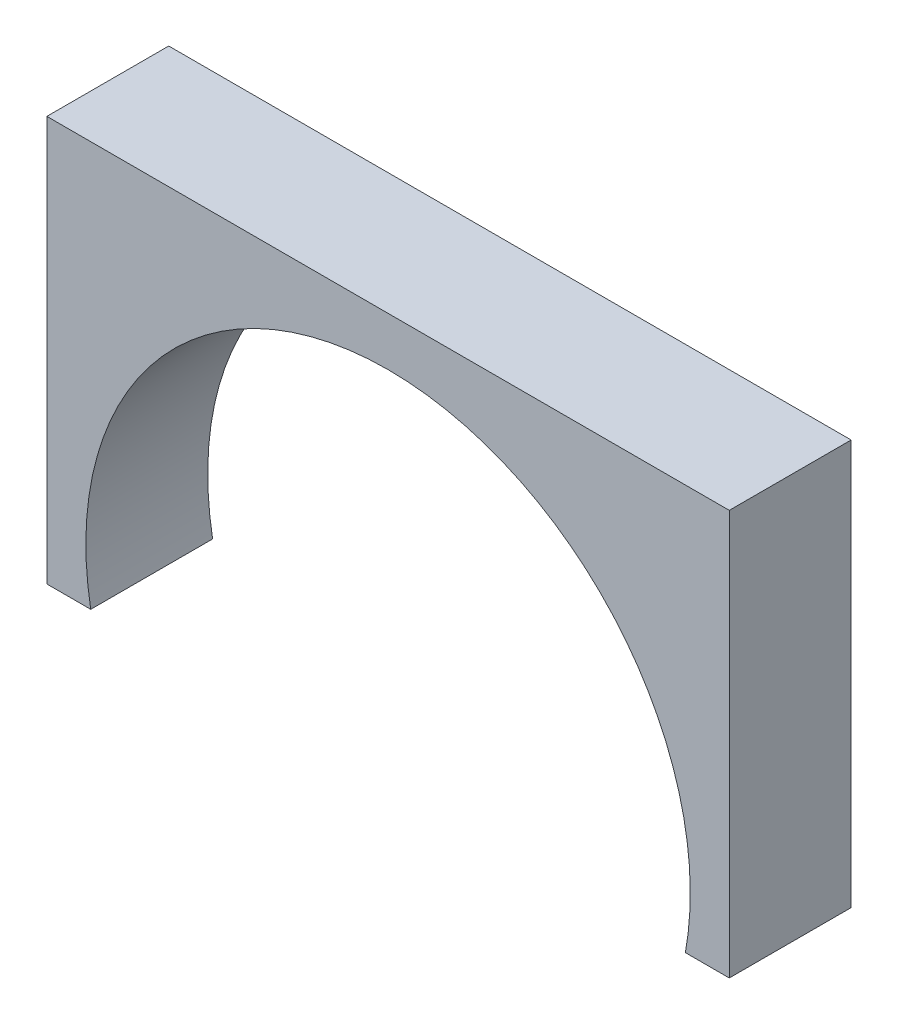
ISO-10303-21;
HEADER;
FILE_DESCRIPTION(('STEP AP214'),'2;1');
FILE_NAME('part.step','',(''),(''),'','','');
FILE_SCHEMA(('AUTOMOTIVE_DESIGN { 1 0 10303 214 1 1 1 1 }'));
ENDSEC;
DATA;
#1=APPLICATION_CONTEXT('core data for automotive mechanical design processes');
#2=APPLICATION_PROTOCOL_DEFINITION('international standard','automotive_design',2000,#1);
#3=PRODUCT_CONTEXT('',#1,'mechanical');
#4=PRODUCT('Part','Part','',(#3));
#5=PRODUCT_RELATED_PRODUCT_CATEGORY('part','',(#4));
#6=PRODUCT_DEFINITION_FORMATION('','',#4);
#7=PRODUCT_DEFINITION_CONTEXT('part definition',#1,'design');
#8=PRODUCT_DEFINITION('design','',#6,#7);
#9=PRODUCT_DEFINITION_SHAPE('','',#8);
#10=(LENGTH_UNIT() NAMED_UNIT(*) SI_UNIT(.MILLI.,.METRE.));
#11=(NAMED_UNIT(*) PLANE_ANGLE_UNIT() SI_UNIT($,.RADIAN.));
#12=(NAMED_UNIT(*) SI_UNIT($,.STERADIAN.) SOLID_ANGLE_UNIT());
#13=UNCERTAINTY_MEASURE_WITH_UNIT(LENGTH_MEASURE(1.E-05),#10,'distance_accuracy_value','');
#14=(GEOMETRIC_REPRESENTATION_CONTEXT(3) GLOBAL_UNCERTAINTY_ASSIGNED_CONTEXT((#13)) GLOBAL_UNIT_ASSIGNED_CONTEXT((#10,
#11,#12)) REPRESENTATION_CONTEXT('',''));
#15=CARTESIAN_POINT('',(0.,0.,0.));
#16=DIRECTION('',(0.,0.,1.));
#17=DIRECTION('',(1.,0.,0.));
#18=AXIS2_PLACEMENT_3D('',#15,#16,#17);
#19=CARTESIAN_POINT('',(-70.,72.,25.));
#20=DIRECTION('',(0.,-1.,0.));
#21=DIRECTION('',(0.,0.,-1.));
#22=AXIS2_PLACEMENT_3D('',#19,#20,#21);
#23=PLANE('',#22);
#24=DIRECTION('',(-1.,0.,0.));
#25=VECTOR('',#24,1.);
#26=CARTESIAN_POINT('',(-70.,72.,0.));
#27=LINE('',#26,#25);
#28=CARTESIAN_POINT('',(70.,72.,0.));
#29=VERTEX_POINT('',#28);
#30=CARTESIAN_POINT('',(-70.,72.,0.));
#31=VERTEX_POINT('',#30);
#32=EDGE_CURVE('E117',#29,#31,#27,.T.);
#33=ORIENTED_EDGE('',*,*,#32,.T.);
#34=DIRECTION('',(0.,0.,-1.));
#35=VECTOR('',#34,1.);
#36=CARTESIAN_POINT('',(-70.,72.,25.));
#37=LINE('',#36,#35);
#38=CARTESIAN_POINT('',(-70.,72.,25.));
#39=VERTEX_POINT('',#38);
#40=EDGE_CURVE('E11',#39,#31,#37,.T.);
#41=ORIENTED_EDGE('',*,*,#40,.F.);
#42=DIRECTION('',(-1.,0.,0.));
#43=VECTOR('',#42,1.);
#44=CARTESIAN_POINT('',(-70.,72.,25.));
#45=LINE('',#44,#43);
#46=CARTESIAN_POINT('',(70.,72.,25.));
#47=VERTEX_POINT('',#46);
#48=EDGE_CURVE('E127',#47,#39,#45,.T.);
#49=ORIENTED_EDGE('',*,*,#48,.F.);
#50=DIRECTION('',(0.,0.,-1.));
#51=VECTOR('',#50,1.);
#52=CARTESIAN_POINT('',(70.,72.,25.));
#53=LINE('',#52,#51);
#54=EDGE_CURVE('E113',#47,#29,#53,.T.);
#55=ORIENTED_EDGE('',*,*,#54,.T.);
#56=EDGE_LOOP('',(#33,#41,#49,#55));
#57=FACE_BOUND('',#56,.T.);
#58=ADVANCED_FACE('F33',(#57),#23,.F.);
#59=CARTESIAN_POINT('',(-70.,72.,25.));
#60=DIRECTION('',(1.,0.,0.));
#61=DIRECTION('',(0.,1.,0.));
#62=AXIS2_PLACEMENT_3D('',#59,#60,#61);
#63=PLANE('',#62);
#64=DIRECTION('',(0.,-1.,0.));
#65=VECTOR('',#64,1.);
#66=CARTESIAN_POINT('',(-70.,72.,0.));
#67=LINE('',#66,#65);
#68=CARTESIAN_POINT('',(-70.,-11.0905365064094,0.));
#69=VERTEX_POINT('',#68);
#70=EDGE_CURVE('E120',#31,#69,#67,.T.);
#71=ORIENTED_EDGE('',*,*,#70,.T.);
#72=DIRECTION('',(0.,0.,-1.));
#73=VECTOR('',#72,1.);
#74=CARTESIAN_POINT('',(-70.,-11.0905365064094,25.));
#75=LINE('',#74,#73);
#76=CARTESIAN_POINT('',(-70.,-11.0905365064094,25.));
#77=VERTEX_POINT('',#76);
#78=EDGE_CURVE('E41',#77,#69,#75,.T.);
#79=ORIENTED_EDGE('',*,*,#78,.F.);
#80=DIRECTION('',(0.,-1.,0.));
#81=VECTOR('',#80,1.);
#82=CARTESIAN_POINT('',(-70.,72.,25.));
#83=LINE('',#82,#81);
#84=EDGE_CURVE('E86',#39,#77,#83,.T.);
#85=ORIENTED_EDGE('',*,*,#84,.F.);
#86=ORIENTED_EDGE('',*,*,#40,.T.);
#87=EDGE_LOOP('',(#71,#79,#85,#86));
#88=FACE_BOUND('',#87,.T.);
#89=ADVANCED_FACE('F151',(#88),#63,.F.);
#90=CARTESIAN_POINT('',(-61.,-11.0905365064094,25.));
#91=DIRECTION('',(0.,1.,0.));
#92=DIRECTION('',(-1.,0.,0.));
#93=AXIS2_PLACEMENT_3D('',#90,#91,#92);
#94=PLANE('',#93);
#95=DIRECTION('',(1.,0.,0.));
#96=VECTOR('',#95,1.);
#97=CARTESIAN_POINT('',(-61.,-11.0905365064094,0.));
#98=LINE('',#97,#96);
#99=CARTESIAN_POINT('',(-61.,-11.0905365064094,0.));
#100=VERTEX_POINT('',#99);
#101=EDGE_CURVE('E122',#69,#100,#98,.T.);
#102=ORIENTED_EDGE('',*,*,#101,.T.);
#103=DIRECTION('',(0.,0.,-1.));
#104=VECTOR('',#103,1.);
#105=CARTESIAN_POINT('',(-61.,-11.0905365064094,25.));
#106=LINE('',#105,#104);
#107=CARTESIAN_POINT('',(-61.,-11.0905365064094,25.));
#108=VERTEX_POINT('',#107);
#109=EDGE_CURVE('E108',#108,#100,#106,.T.);
#110=ORIENTED_EDGE('',*,*,#109,.F.);
#111=DIRECTION('',(1.,0.,0.));
#112=VECTOR('',#111,1.);
#113=CARTESIAN_POINT('',(-61.,-11.0905365064094,25.));
#114=LINE('',#113,#112);
#115=EDGE_CURVE('E99',#77,#108,#114,.T.);
#116=ORIENTED_EDGE('',*,*,#115,.F.);
#117=ORIENTED_EDGE('',*,*,#78,.T.);
#118=EDGE_LOOP('',(#102,#110,#116,#117));
#119=FACE_BOUND('',#118,.T.);
#120=ADVANCED_FACE('F133',(#119),#94,.F.);
#121=CARTESIAN_POINT('',(0.,0.,25.));
#122=DIRECTION('',(0.,0.,-1.));
#123=DIRECTION('',(-1.,0.,0.));
#124=AXIS2_PLACEMENT_3D('',#121,#122,#123);
#125=CYLINDRICAL_SURFACE('',#124,62.);
#126=CARTESIAN_POINT('',(0.,0.,0.));
#127=DIRECTION('',(0.,0.,-1.));
#128=DIRECTION('',(1.,0.,0.));
#129=AXIS2_PLACEMENT_3D('',#126,#127,#128);
#130=CIRCLE('',#129,62.);
#131=CARTESIAN_POINT('',(61.,-11.0905365064094,0.));
#132=VERTEX_POINT('',#131);
#133=EDGE_CURVE('E107',#100,#132,#130,.T.);
#134=ORIENTED_EDGE('',*,*,#133,.T.);
#135=DIRECTION('',(0.,0.,-1.));
#136=VECTOR('',#135,1.);
#137=CARTESIAN_POINT('',(61.,-11.0905365064094,25.));
#138=LINE('',#137,#136);
#139=CARTESIAN_POINT('',(61.,-11.0905365064094,25.));
#140=VERTEX_POINT('',#139);
#141=EDGE_CURVE('E104',#140,#132,#138,.T.);
#142=ORIENTED_EDGE('',*,*,#141,.F.);
#143=CARTESIAN_POINT('',(0.,0.,25.));
#144=DIRECTION('',(0.,0.,-1.));
#145=DIRECTION('',(1.,0.,0.));
#146=AXIS2_PLACEMENT_3D('',#143,#144,#145);
#147=CIRCLE('',#146,62.);
#148=EDGE_CURVE('E93',#108,#140,#147,.T.);
#149=ORIENTED_EDGE('',*,*,#148,.F.);
#150=ORIENTED_EDGE('',*,*,#109,.T.);
#151=EDGE_LOOP('',(#134,#142,#149,#150));
#152=FACE_BOUND('',#151,.T.);
#153=ADVANCED_FACE('F105',(#152),#125,.F.);
#154=CARTESIAN_POINT('',(61.,-11.0905365064094,25.));
#155=DIRECTION('',(0.,1.,0.));
#156=DIRECTION('',(0.,0.,1.));
#157=AXIS2_PLACEMENT_3D('',#154,#155,#156);
#158=PLANE('',#157);
#159=DIRECTION('',(1.,0.,0.));
#160=VECTOR('',#159,1.);
#161=CARTESIAN_POINT('',(61.,-11.0905365064094,0.));
#162=LINE('',#161,#160);
#163=CARTESIAN_POINT('',(70.,-11.0905365064094,0.));
#164=VERTEX_POINT('',#163);
#165=EDGE_CURVE('E72',#132,#164,#162,.T.);
#166=ORIENTED_EDGE('',*,*,#165,.T.);
#167=DIRECTION('',(0.,0.,-1.));
#168=VECTOR('',#167,1.);
#169=CARTESIAN_POINT('',(70.,-11.0905365064094,25.));
#170=LINE('',#169,#168);
#171=CARTESIAN_POINT('',(70.,-11.0905365064094,25.));
#172=VERTEX_POINT('',#171);
#173=EDGE_CURVE('E109',#172,#164,#170,.T.);
#174=ORIENTED_EDGE('',*,*,#173,.F.);
#175=DIRECTION('',(1.,0.,0.));
#176=VECTOR('',#175,1.);
#177=CARTESIAN_POINT('',(61.,-11.0905365064094,25.));
#178=LINE('',#177,#176);
#179=EDGE_CURVE('E97',#140,#172,#178,.T.);
#180=ORIENTED_EDGE('',*,*,#179,.F.);
#181=ORIENTED_EDGE('',*,*,#141,.T.);
#182=EDGE_LOOP('',(#166,#174,#180,#181));
#183=FACE_BOUND('',#182,.T.);
#184=ADVANCED_FACE('F111',(#183),#158,.F.);
#185=CARTESIAN_POINT('',(70.,72.,25.));
#186=DIRECTION('',(-1.,0.,0.));
#187=DIRECTION('',(0.,-1.,0.));
#188=AXIS2_PLACEMENT_3D('',#185,#186,#187);
#189=PLANE('',#188);
#190=DIRECTION('',(0.,1.,0.));
#191=VECTOR('',#190,1.);
#192=CARTESIAN_POINT('',(70.,72.,0.));
#193=LINE('',#192,#191);
#194=EDGE_CURVE('E78',#164,#29,#193,.T.);
#195=ORIENTED_EDGE('',*,*,#194,.T.);
#196=ORIENTED_EDGE('',*,*,#54,.F.);
#197=DIRECTION('',(0.,1.,0.));
#198=VECTOR('',#197,1.);
#199=CARTESIAN_POINT('',(70.,72.,25.));
#200=LINE('',#199,#198);
#201=EDGE_CURVE('E49',#172,#47,#200,.T.);
#202=ORIENTED_EDGE('',*,*,#201,.F.);
#203=ORIENTED_EDGE('',*,*,#173,.T.);
#204=EDGE_LOOP('',(#195,#196,#202,#203));
#205=FACE_BOUND('',#204,.T.);
#206=ADVANCED_FACE('F140',(#205),#189,.F.);
#207=CARTESIAN_POINT('',(0.,0.,25.));
#208=DIRECTION('',(0.,0.,1.));
#209=DIRECTION('',(1.,0.,0.));
#210=AXIS2_PLACEMENT_3D('',#207,#208,#209);
#211=PLANE('',#210);
#212=ORIENTED_EDGE('',*,*,#48,.T.);
#213=ORIENTED_EDGE('',*,*,#84,.T.);
#214=ORIENTED_EDGE('',*,*,#115,.T.);
#215=ORIENTED_EDGE('',*,*,#148,.T.);
#216=ORIENTED_EDGE('',*,*,#179,.T.);
#217=ORIENTED_EDGE('',*,*,#201,.T.);
#218=EDGE_LOOP('',(#212,#213,#214,#215,#216,#217));
#219=FACE_BOUND('',#218,.T.);
#220=ADVANCED_FACE('F95',(#219),#211,.T.);
#221=CARTESIAN_POINT('',(0.,0.,0.));
#222=DIRECTION('',(0.,0.,1.));
#223=DIRECTION('',(1.,0.,0.));
#224=AXIS2_PLACEMENT_3D('',#221,#222,#223);
#225=PLANE('',#224);
#226=ORIENTED_EDGE('',*,*,#32,.F.);
#227=ORIENTED_EDGE('',*,*,#194,.F.);
#228=ORIENTED_EDGE('',*,*,#165,.F.);
#229=ORIENTED_EDGE('',*,*,#133,.F.);
#230=ORIENTED_EDGE('',*,*,#101,.F.);
#231=ORIENTED_EDGE('',*,*,#70,.F.);
#232=EDGE_LOOP('',(#226,#227,#228,#229,#230,#231));
#233=FACE_BOUND('',#232,.T.);
#234=ADVANCED_FACE('F136',(#233),#225,.F.);
#235=CLOSED_SHELL('',(#58,#89,#120,#153,#184,#206,#220,#234));
#236=MANIFOLD_SOLID_BREP('B2',#235);
#237=ADVANCED_BREP_SHAPE_REPRESENTATION('',(#18,#236),#14);
#238=SHAPE_DEFINITION_REPRESENTATION(#9,#237);
ENDSEC;
END-ISO-10303-21;
